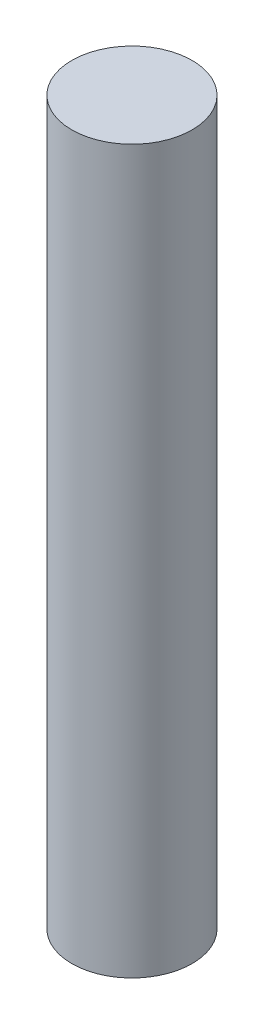
ISO-10303-21;
HEADER;
FILE_DESCRIPTION(('STEP AP214'),'2;1');
FILE_NAME('part.step','',(''),(''),'','','');
FILE_SCHEMA(('AUTOMOTIVE_DESIGN { 1 0 10303 214 1 1 1 1 }'));
ENDSEC;
DATA;
#1=APPLICATION_CONTEXT('core data for automotive mechanical design processes');
#2=APPLICATION_PROTOCOL_DEFINITION('international standard','automotive_design',2000,#1);
#3=PRODUCT_CONTEXT('',#1,'mechanical');
#4=PRODUCT('Part','Part','',(#3));
#5=PRODUCT_RELATED_PRODUCT_CATEGORY('part','',(#4));
#6=PRODUCT_DEFINITION_FORMATION('','',#4);
#7=PRODUCT_DEFINITION_CONTEXT('part definition',#1,'design');
#8=PRODUCT_DEFINITION('design','',#6,#7);
#9=PRODUCT_DEFINITION_SHAPE('','',#8);
#10=(LENGTH_UNIT() NAMED_UNIT(*) SI_UNIT(.MILLI.,.METRE.));
#11=(NAMED_UNIT(*) PLANE_ANGLE_UNIT() SI_UNIT($,.RADIAN.));
#12=(NAMED_UNIT(*) SI_UNIT($,.STERADIAN.) SOLID_ANGLE_UNIT());
#13=UNCERTAINTY_MEASURE_WITH_UNIT(LENGTH_MEASURE(1.E-05),#10,'distance_accuracy_value','');
#14=(GEOMETRIC_REPRESENTATION_CONTEXT(3) GLOBAL_UNCERTAINTY_ASSIGNED_CONTEXT((#13)) GLOBAL_UNIT_ASSIGNED_CONTEXT((#10,
#11,#12)) REPRESENTATION_CONTEXT('',''));
#15=CARTESIAN_POINT('',(0.,0.,0.));
#16=DIRECTION('',(0.,0.,1.));
#17=DIRECTION('',(1.,0.,0.));
#18=AXIS2_PLACEMENT_3D('',#15,#16,#17);
#19=CARTESIAN_POINT('',(0.,15.,0.));
#20=DIRECTION('',(0.,-1.,0.));
#21=DIRECTION('',(0.,0.,-1.));
#22=AXIS2_PLACEMENT_3D('',#19,#20,#21);
#23=CYLINDRICAL_SURFACE('',#22,1.25);
#24=CARTESIAN_POINT('',(0.,15.,0.));
#25=DIRECTION('',(0.,1.,0.));
#26=DIRECTION('',(0.,0.,1.));
#27=AXIS2_PLACEMENT_3D('',#24,#25,#26);
#28=CIRCLE('',#27,1.25);
#29=CARTESIAN_POINT('',(0.,15.,1.25));
#30=VERTEX_POINT('',#29);
#31=EDGE_CURVE('E10',#30,#30,#28,.T.);
#32=ORIENTED_EDGE('',*,*,#31,.F.);
#33=EDGE_LOOP('',(#32));
#34=FACE_BOUND('',#33,.T.);
#35=CARTESIAN_POINT('',(0.,0.,0.));
#36=DIRECTION('',(0.,1.,0.));
#37=DIRECTION('',(0.,0.,1.));
#38=AXIS2_PLACEMENT_3D('',#35,#36,#37);
#39=CIRCLE('',#38,1.25);
#40=CARTESIAN_POINT('',(0.,0.,1.25));
#41=VERTEX_POINT('',#40);
#42=EDGE_CURVE('E40',#41,#41,#39,.T.);
#43=ORIENTED_EDGE('',*,*,#42,.T.);
#44=EDGE_LOOP('',(#43));
#45=FACE_BOUND('',#44,.T.);
#46=ADVANCED_FACE('F37',(#34,#45),#23,.T.);
#47=CARTESIAN_POINT('',(0.,15.,0.));
#48=DIRECTION('',(0.,1.,0.));
#49=DIRECTION('',(0.,0.,1.));
#50=AXIS2_PLACEMENT_3D('',#47,#48,#49);
#51=PLANE('',#50);
#52=ORIENTED_EDGE('',*,*,#31,.T.);
#53=EDGE_LOOP('',(#52));
#54=FACE_BOUND('',#53,.T.);
#55=ADVANCED_FACE('F54',(#54),#51,.T.);
#56=CARTESIAN_POINT('',(0.,0.,0.));
#57=DIRECTION('',(0.,1.,0.));
#58=DIRECTION('',(0.,0.,1.));
#59=AXIS2_PLACEMENT_3D('',#56,#57,#58);
#60=PLANE('',#59);
#61=ORIENTED_EDGE('',*,*,#42,.F.);
#62=EDGE_LOOP('',(#61));
#63=FACE_BOUND('',#62,.T.);
#64=ADVANCED_FACE('F52',(#63),#60,.F.);
#65=CLOSED_SHELL('',(#46,#55,#64));
#66=MANIFOLD_SOLID_BREP('B2',#65);
#67=ADVANCED_BREP_SHAPE_REPRESENTATION('',(#18,#66),#14);
#68=SHAPE_DEFINITION_REPRESENTATION(#9,#67);
ENDSEC;
END-ISO-10303-21;
